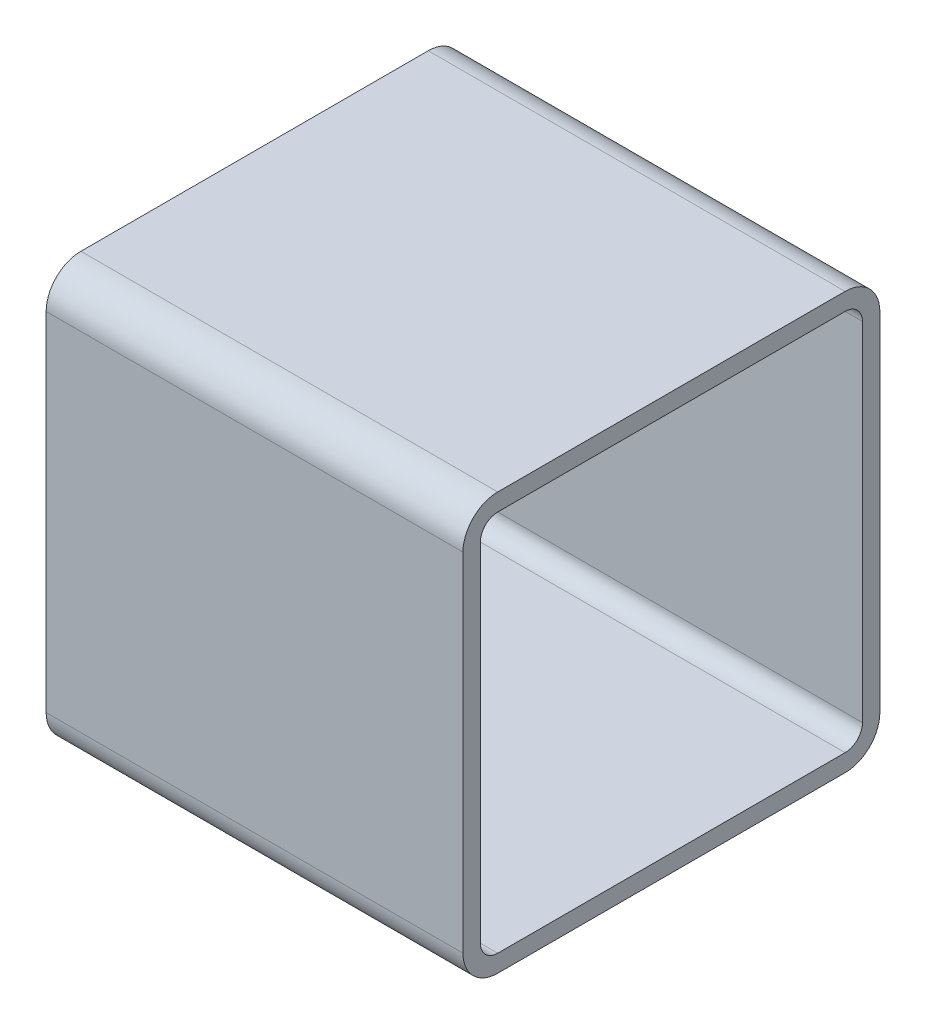
ISO-10303-21;
HEADER;
FILE_DESCRIPTION(('STEP AP214'),'2;1');
FILE_NAME('part.step','',(''),(''),'','','');
FILE_SCHEMA(('AUTOMOTIVE_DESIGN { 1 0 10303 214 1 1 1 1 }'));
ENDSEC;
DATA;
#1=APPLICATION_CONTEXT('core data for automotive mechanical design processes');
#2=APPLICATION_PROTOCOL_DEFINITION('international standard','automotive_design',2000,#1);
#3=PRODUCT_CONTEXT('',#1,'mechanical');
#4=PRODUCT('Part','Part','',(#3));
#5=PRODUCT_RELATED_PRODUCT_CATEGORY('part','',(#4));
#6=PRODUCT_DEFINITION_FORMATION('','',#4);
#7=PRODUCT_DEFINITION_CONTEXT('part definition',#1,'design');
#8=PRODUCT_DEFINITION('design','',#6,#7);
#9=PRODUCT_DEFINITION_SHAPE('','',#8);
#10=(LENGTH_UNIT() NAMED_UNIT(*) SI_UNIT(.MILLI.,.METRE.));
#11=(NAMED_UNIT(*) PLANE_ANGLE_UNIT() SI_UNIT($,.RADIAN.));
#12=(NAMED_UNIT(*) SI_UNIT($,.STERADIAN.) SOLID_ANGLE_UNIT());
#13=UNCERTAINTY_MEASURE_WITH_UNIT(LENGTH_MEASURE(1.E-05),#10,'distance_accuracy_value','');
#14=(GEOMETRIC_REPRESENTATION_CONTEXT(3) GLOBAL_UNCERTAINTY_ASSIGNED_CONTEXT((#13)) GLOBAL_UNIT_ASSIGNED_CONTEXT((#10,
#11,#12)) REPRESENTATION_CONTEXT('',''));
#15=CARTESIAN_POINT('',(0.,0.,0.));
#16=DIRECTION('',(0.,0.,1.));
#17=DIRECTION('',(1.,0.,0.));
#18=AXIS2_PLACEMENT_3D('',#15,#16,#17);
#19=CARTESIAN_POINT('',(0.,6.35,-38.1));
#20=DIRECTION('',(0.,0.,-1.));
#21=DIRECTION('',(-1.,0.,0.));
#22=AXIS2_PLACEMENT_3D('',#19,#20,#21);
#23=PLANE('',#22);
#24=DIRECTION('',(1.,0.,0.));
#25=VECTOR('',#24,1.);
#26=CARTESIAN_POINT('',(0.,6.35,-38.1));
#27=LINE('',#26,#25);
#28=CARTESIAN_POINT('',(0.,6.35,-38.1));
#29=VERTEX_POINT('',#28);
#30=CARTESIAN_POINT('',(76.2,6.35,-38.1));
#31=VERTEX_POINT('',#30);
#32=EDGE_CURVE('E111',#29,#31,#27,.T.);
#33=ORIENTED_EDGE('',*,*,#32,.F.);
#34=DIRECTION('',(0.,1.,0.));
#35=VECTOR('',#34,1.);
#36=CARTESIAN_POINT('',(0.,0.,-38.1));
#37=LINE('',#36,#35);
#38=CARTESIAN_POINT('',(0.,69.85,-38.1));
#39=VERTEX_POINT('',#38);
#40=EDGE_CURVE('E213',#29,#39,#37,.T.);
#41=ORIENTED_EDGE('',*,*,#40,.T.);
#42=DIRECTION('',(1.,0.,0.));
#43=VECTOR('',#42,1.);
#44=CARTESIAN_POINT('',(0.,69.85,-38.1));
#45=LINE('',#44,#43);
#46=CARTESIAN_POINT('',(76.2,69.85,-38.1));
#47=VERTEX_POINT('',#46);
#48=EDGE_CURVE('E188',#47,#39,#45,.F.);
#49=ORIENTED_EDGE('',*,*,#48,.F.);
#50=DIRECTION('',(0.,1.,0.));
#51=VECTOR('',#50,1.);
#52=CARTESIAN_POINT('',(76.2,0.,-38.1));
#53=LINE('',#52,#51);
#54=EDGE_CURVE('E115',#31,#47,#53,.T.);
#55=ORIENTED_EDGE('',*,*,#54,.F.);
#56=EDGE_LOOP('',(#33,#41,#49,#55));
#57=FACE_BOUND('',#56,.T.);
#58=ADVANCED_FACE('F17',(#57),#23,.T.);
#59=CARTESIAN_POINT('',(0.,69.85,-31.75));
#60=DIRECTION('',(1.,0.,0.));
#61=DIRECTION('',(0.,0.,-1.));
#62=AXIS2_PLACEMENT_3D('',#59,#60,#61);
#63=CYLINDRICAL_SURFACE('',#62,6.35);
#64=ORIENTED_EDGE('',*,*,#48,.T.);
#65=CARTESIAN_POINT('',(0.,69.85,-31.75));
#66=DIRECTION('',(1.,0.,0.));
#67=DIRECTION('',(0.,0.,-1.));
#68=AXIS2_PLACEMENT_3D('',#65,#66,#67);
#69=CIRCLE('',#68,6.35);
#70=CARTESIAN_POINT('',(0.,76.2,-31.75));
#71=VERTEX_POINT('',#70);
#72=EDGE_CURVE('E211',#39,#71,#69,.T.);
#73=ORIENTED_EDGE('',*,*,#72,.T.);
#74=DIRECTION('',(1.,0.,0.));
#75=VECTOR('',#74,1.);
#76=CARTESIAN_POINT('',(0.,76.2,-31.75));
#77=LINE('',#76,#75);
#78=CARTESIAN_POINT('',(76.2,76.2,-31.75));
#79=VERTEX_POINT('',#78);
#80=EDGE_CURVE('E185',#79,#71,#77,.F.);
#81=ORIENTED_EDGE('',*,*,#80,.F.);
#82=CARTESIAN_POINT('',(76.2,69.85,-31.75));
#83=DIRECTION('',(1.,0.,0.));
#84=DIRECTION('',(0.,0.,-1.));
#85=AXIS2_PLACEMENT_3D('',#82,#83,#84);
#86=CIRCLE('',#85,6.35);
#87=EDGE_CURVE('E154',#47,#79,#86,.T.);
#88=ORIENTED_EDGE('',*,*,#87,.F.);
#89=EDGE_LOOP('',(#64,#73,#81,#88));
#90=FACE_BOUND('',#89,.T.);
#91=ADVANCED_FACE('F229',(#90),#63,.T.);
#92=CARTESIAN_POINT('',(0.,76.2,-31.75));
#93=DIRECTION('',(0.,1.,0.));
#94=DIRECTION('',(0.,0.,1.));
#95=AXIS2_PLACEMENT_3D('',#92,#93,#94);
#96=PLANE('',#95);
#97=ORIENTED_EDGE('',*,*,#80,.T.);
#98=DIRECTION('',(0.,0.,-1.));
#99=VECTOR('',#98,1.);
#100=CARTESIAN_POINT('',(0.,76.2,0.));
#101=LINE('',#100,#99);
#102=CARTESIAN_POINT('',(0.,76.2,31.75));
#103=VERTEX_POINT('',#102);
#104=EDGE_CURVE('E210',#71,#103,#101,.F.);
#105=ORIENTED_EDGE('',*,*,#104,.T.);
#106=DIRECTION('',(1.,0.,0.));
#107=VECTOR('',#106,1.);
#108=CARTESIAN_POINT('',(0.,76.2,31.75));
#109=LINE('',#108,#107);
#110=CARTESIAN_POINT('',(76.2,76.2,31.75));
#111=VERTEX_POINT('',#110);
#112=EDGE_CURVE('E182',#111,#103,#109,.F.);
#113=ORIENTED_EDGE('',*,*,#112,.F.);
#114=DIRECTION('',(0.,0.,-1.));
#115=VECTOR('',#114,1.);
#116=CARTESIAN_POINT('',(76.2,76.2,0.));
#117=LINE('',#116,#115);
#118=EDGE_CURVE('E151',#79,#111,#117,.F.);
#119=ORIENTED_EDGE('',*,*,#118,.F.);
#120=EDGE_LOOP('',(#97,#105,#113,#119));
#121=FACE_BOUND('',#120,.T.);
#122=ADVANCED_FACE('F233',(#121),#96,.T.);
#123=CARTESIAN_POINT('',(0.,69.85,31.75));
#124=DIRECTION('',(1.,0.,0.));
#125=DIRECTION('',(0.,0.,-1.));
#126=AXIS2_PLACEMENT_3D('',#123,#124,#125);
#127=CYLINDRICAL_SURFACE('',#126,6.35);
#128=ORIENTED_EDGE('',*,*,#112,.T.);
#129=CARTESIAN_POINT('',(0.,69.85,31.75));
#130=DIRECTION('',(1.,0.,0.));
#131=DIRECTION('',(0.,0.,-1.));
#132=AXIS2_PLACEMENT_3D('',#129,#130,#131);
#133=CIRCLE('',#132,6.35);
#134=CARTESIAN_POINT('',(0.,69.85,38.1));
#135=VERTEX_POINT('',#134);
#136=EDGE_CURVE('E208',#103,#135,#133,.T.);
#137=ORIENTED_EDGE('',*,*,#136,.T.);
#138=DIRECTION('',(1.,0.,0.));
#139=VECTOR('',#138,1.);
#140=CARTESIAN_POINT('',(0.,69.85,38.1));
#141=LINE('',#140,#139);
#142=CARTESIAN_POINT('',(76.2,69.85,38.1));
#143=VERTEX_POINT('',#142);
#144=EDGE_CURVE('E176',#143,#135,#141,.F.);
#145=ORIENTED_EDGE('',*,*,#144,.F.);
#146=CARTESIAN_POINT('',(76.2,69.85,31.75));
#147=DIRECTION('',(1.,0.,0.));
#148=DIRECTION('',(0.,0.,-1.));
#149=AXIS2_PLACEMENT_3D('',#146,#147,#148);
#150=CIRCLE('',#149,6.35);
#151=EDGE_CURVE('E150',#111,#143,#150,.T.);
#152=ORIENTED_EDGE('',*,*,#151,.F.);
#153=EDGE_LOOP('',(#128,#137,#145,#152));
#154=FACE_BOUND('',#153,.T.);
#155=ADVANCED_FACE('F237',(#154),#127,.T.);
#156=CARTESIAN_POINT('',(0.,69.85,38.1));
#157=DIRECTION('',(0.,0.,1.));
#158=DIRECTION('',(1.,0.,0.));
#159=AXIS2_PLACEMENT_3D('',#156,#157,#158);
#160=PLANE('',#159);
#161=ORIENTED_EDGE('',*,*,#144,.T.);
#162=DIRECTION('',(0.,1.,0.));
#163=VECTOR('',#162,1.);
#164=CARTESIAN_POINT('',(0.,0.,38.1));
#165=LINE('',#164,#163);
#166=CARTESIAN_POINT('',(0.,6.35,38.1));
#167=VERTEX_POINT('',#166);
#168=EDGE_CURVE('E207',#135,#167,#165,.F.);
#169=ORIENTED_EDGE('',*,*,#168,.T.);
#170=DIRECTION('',(1.,0.,0.));
#171=VECTOR('',#170,1.);
#172=CARTESIAN_POINT('',(0.,6.35,38.1));
#173=LINE('',#172,#171);
#174=CARTESIAN_POINT('',(76.2,6.35,38.1));
#175=VERTEX_POINT('',#174);
#176=EDGE_CURVE('E177',#175,#167,#173,.F.);
#177=ORIENTED_EDGE('',*,*,#176,.F.);
#178=DIRECTION('',(0.,1.,0.));
#179=VECTOR('',#178,1.);
#180=CARTESIAN_POINT('',(76.2,0.,38.1));
#181=LINE('',#180,#179);
#182=EDGE_CURVE('E148',#143,#175,#181,.F.);
#183=ORIENTED_EDGE('',*,*,#182,.F.);
#184=EDGE_LOOP('',(#161,#169,#177,#183));
#185=FACE_BOUND('',#184,.T.);
#186=ADVANCED_FACE('F242',(#185),#160,.T.);
#187=CARTESIAN_POINT('',(0.,69.85,-31.75));
#188=DIRECTION('',(1.,0.,0.));
#189=DIRECTION('',(0.,0.,-1.));
#190=AXIS2_PLACEMENT_3D('',#187,#188,#189);
#191=CYLINDRICAL_SURFACE('',#190,3.175);
#192=CARTESIAN_POINT('',(76.2,69.85,-31.75));
#193=DIRECTION('',(1.,0.,0.));
#194=DIRECTION('',(0.,0.,-1.));
#195=AXIS2_PLACEMENT_3D('',#192,#193,#194);
#196=CIRCLE('',#195,3.175);
#197=CARTESIAN_POINT('',(76.2,73.025,-31.75));
#198=VERTEX_POINT('',#197);
#199=CARTESIAN_POINT('',(76.2,69.85,-34.925));
#200=VERTEX_POINT('',#199);
#201=EDGE_CURVE('E135',#198,#200,#196,.F.);
#202=ORIENTED_EDGE('',*,*,#201,.F.);
#203=DIRECTION('',(1.,0.,0.));
#204=VECTOR('',#203,1.);
#205=CARTESIAN_POINT('',(0.,73.025,-31.75));
#206=LINE('',#205,#204);
#207=CARTESIAN_POINT('',(0.,73.025,-31.75));
#208=VERTEX_POINT('',#207);
#209=EDGE_CURVE('E159',#208,#198,#206,.T.);
#210=ORIENTED_EDGE('',*,*,#209,.F.);
#211=CARTESIAN_POINT('',(0.,69.85,-31.75));
#212=DIRECTION('',(1.,0.,0.));
#213=DIRECTION('',(0.,0.,-1.));
#214=AXIS2_PLACEMENT_3D('',#211,#212,#213);
#215=CIRCLE('',#214,3.175);
#216=CARTESIAN_POINT('',(0.,69.85,-34.925));
#217=VERTEX_POINT('',#216);
#218=EDGE_CURVE('E203',#208,#217,#215,.F.);
#219=ORIENTED_EDGE('',*,*,#218,.T.);
#220=DIRECTION('',(1.,0.,0.));
#221=VECTOR('',#220,1.);
#222=CARTESIAN_POINT('',(0.,69.85,-34.925));
#223=LINE('',#222,#221);
#224=EDGE_CURVE('E173',#200,#217,#223,.F.);
#225=ORIENTED_EDGE('',*,*,#224,.F.);
#226=EDGE_LOOP('',(#202,#210,#219,#225));
#227=FACE_BOUND('',#226,.T.);
#228=ADVANCED_FACE('F307',(#227),#191,.F.);
#229=CARTESIAN_POINT('',(0.,69.85,-34.925));
#230=DIRECTION('',(0.,0.,1.));
#231=DIRECTION('',(1.,0.,0.));
#232=AXIS2_PLACEMENT_3D('',#229,#230,#231);
#233=PLANE('',#232);
#234=ORIENTED_EDGE('',*,*,#224,.T.);
#235=DIRECTION('',(0.,1.,0.));
#236=VECTOR('',#235,1.);
#237=CARTESIAN_POINT('',(0.,0.,-34.925));
#238=LINE('',#237,#236);
#239=CARTESIAN_POINT('',(0.,6.35,-34.925));
#240=VERTEX_POINT('',#239);
#241=EDGE_CURVE('E202',#217,#240,#238,.F.);
#242=ORIENTED_EDGE('',*,*,#241,.T.);
#243=DIRECTION('',(1.,0.,0.));
#244=VECTOR('',#243,1.);
#245=CARTESIAN_POINT('',(0.,6.35,-34.925));
#246=LINE('',#245,#244);
#247=CARTESIAN_POINT('',(76.2,6.35,-34.925));
#248=VERTEX_POINT('',#247);
#249=EDGE_CURVE('E171',#240,#248,#246,.T.);
#250=ORIENTED_EDGE('',*,*,#249,.T.);
#251=DIRECTION('',(0.,1.,0.));
#252=VECTOR('',#251,1.);
#253=CARTESIAN_POINT('',(76.2,0.,-34.925));
#254=LINE('',#253,#252);
#255=EDGE_CURVE('E145',#200,#248,#254,.F.);
#256=ORIENTED_EDGE('',*,*,#255,.F.);
#257=EDGE_LOOP('',(#234,#242,#250,#256));
#258=FACE_BOUND('',#257,.T.);
#259=ADVANCED_FACE('F306',(#258),#233,.T.);
#260=CARTESIAN_POINT('',(0.,6.35,-31.75));
#261=DIRECTION('',(1.,0.,0.));
#262=DIRECTION('',(0.,0.,-1.));
#263=AXIS2_PLACEMENT_3D('',#260,#261,#262);
#264=CYLINDRICAL_SURFACE('',#263,3.175);
#265=CARTESIAN_POINT('',(76.2,6.35,-31.75));
#266=DIRECTION('',(1.,0.,0.));
#267=DIRECTION('',(0.,0.,-1.));
#268=AXIS2_PLACEMENT_3D('',#265,#266,#267);
#269=CIRCLE('',#268,3.175);
#270=CARTESIAN_POINT('',(76.2,3.175,-31.75));
#271=VERTEX_POINT('',#270);
#272=EDGE_CURVE('E144',#248,#271,#269,.F.);
#273=ORIENTED_EDGE('',*,*,#272,.F.);
#274=ORIENTED_EDGE('',*,*,#249,.F.);
#275=CARTESIAN_POINT('',(0.,6.35,-31.75));
#276=DIRECTION('',(1.,0.,0.));
#277=DIRECTION('',(0.,0.,-1.));
#278=AXIS2_PLACEMENT_3D('',#275,#276,#277);
#279=CIRCLE('',#278,3.175);
#280=CARTESIAN_POINT('',(0.,3.175,-31.75));
#281=VERTEX_POINT('',#280);
#282=EDGE_CURVE('E199',#240,#281,#279,.F.);
#283=ORIENTED_EDGE('',*,*,#282,.T.);
#284=DIRECTION('',(1.,0.,0.));
#285=VECTOR('',#284,1.);
#286=CARTESIAN_POINT('',(0.,3.175,-31.75));
#287=LINE('',#286,#285);
#288=EDGE_CURVE('E168',#271,#281,#287,.F.);
#289=ORIENTED_EDGE('',*,*,#288,.F.);
#290=EDGE_LOOP('',(#273,#274,#283,#289));
#291=FACE_BOUND('',#290,.T.);
#292=ADVANCED_FACE('F304',(#291),#264,.F.);
#293=CARTESIAN_POINT('',(0.,3.175,-31.75));
#294=DIRECTION('',(0.,1.,0.));
#295=DIRECTION('',(0.,0.,1.));
#296=AXIS2_PLACEMENT_3D('',#293,#294,#295);
#297=PLANE('',#296);
#298=ORIENTED_EDGE('',*,*,#288,.T.);
#299=DIRECTION('',(0.,0.,-1.));
#300=VECTOR('',#299,1.);
#301=CARTESIAN_POINT('',(0.,3.175,0.));
#302=LINE('',#301,#300);
#303=CARTESIAN_POINT('',(0.,3.175,31.75));
#304=VERTEX_POINT('',#303);
#305=EDGE_CURVE('E198',#281,#304,#302,.F.);
#306=ORIENTED_EDGE('',*,*,#305,.T.);
#307=DIRECTION('',(1.,0.,0.));
#308=VECTOR('',#307,1.);
#309=CARTESIAN_POINT('',(0.,3.175,31.75));
#310=LINE('',#309,#308);
#311=CARTESIAN_POINT('',(76.2,3.175,31.75));
#312=VERTEX_POINT('',#311);
#313=EDGE_CURVE('E166',#304,#312,#310,.T.);
#314=ORIENTED_EDGE('',*,*,#313,.T.);
#315=DIRECTION('',(0.,0.,-1.));
#316=VECTOR('',#315,1.);
#317=CARTESIAN_POINT('',(76.2,3.175,0.));
#318=LINE('',#317,#316);
#319=EDGE_CURVE('E141',#271,#312,#318,.F.);
#320=ORIENTED_EDGE('',*,*,#319,.F.);
#321=EDGE_LOOP('',(#298,#306,#314,#320));
#322=FACE_BOUND('',#321,.T.);
#323=ADVANCED_FACE('F293',(#322),#297,.T.);
#324=CARTESIAN_POINT('',(0.,6.35,31.75));
#325=DIRECTION('',(1.,0.,0.));
#326=DIRECTION('',(0.,0.,-1.));
#327=AXIS2_PLACEMENT_3D('',#324,#325,#326);
#328=CYLINDRICAL_SURFACE('',#327,3.175);
#329=CARTESIAN_POINT('',(76.2,6.35,31.75));
#330=DIRECTION('',(1.,0.,0.));
#331=DIRECTION('',(0.,0.,-1.));
#332=AXIS2_PLACEMENT_3D('',#329,#330,#331);
#333=CIRCLE('',#332,3.175);
#334=CARTESIAN_POINT('',(76.2,6.35,34.925));
#335=VERTEX_POINT('',#334);
#336=EDGE_CURVE('E140',#312,#335,#333,.F.);
#337=ORIENTED_EDGE('',*,*,#336,.F.);
#338=ORIENTED_EDGE('',*,*,#313,.F.);
#339=CARTESIAN_POINT('',(0.,6.35,31.75));
#340=DIRECTION('',(1.,0.,0.));
#341=DIRECTION('',(0.,0.,-1.));
#342=AXIS2_PLACEMENT_3D('',#339,#340,#341);
#343=CIRCLE('',#342,3.175);
#344=CARTESIAN_POINT('',(0.,6.35,34.925));
#345=VERTEX_POINT('',#344);
#346=EDGE_CURVE('E195',#304,#345,#343,.F.);
#347=ORIENTED_EDGE('',*,*,#346,.T.);
#348=DIRECTION('',(-1.,0.,0.));
#349=VECTOR('',#348,1.);
#350=CARTESIAN_POINT('',(0.,6.35,34.925));
#351=LINE('',#350,#349);
#352=EDGE_CURVE('E163',#335,#345,#351,.T.);
#353=ORIENTED_EDGE('',*,*,#352,.F.);
#354=EDGE_LOOP('',(#337,#338,#347,#353));
#355=FACE_BOUND('',#354,.T.);
#356=ADVANCED_FACE('F298',(#355),#328,.F.);
#357=CARTESIAN_POINT('',(0.,6.35,34.925));
#358=DIRECTION('',(0.,0.,-1.));
#359=DIRECTION('',(-1.,0.,0.));
#360=AXIS2_PLACEMENT_3D('',#357,#358,#359);
#361=PLANE('',#360);
#362=ORIENTED_EDGE('',*,*,#352,.T.);
#363=DIRECTION('',(0.,1.,0.));
#364=VECTOR('',#363,1.);
#365=CARTESIAN_POINT('',(0.,0.,34.925));
#366=LINE('',#365,#364);
#367=CARTESIAN_POINT('',(0.,69.85,34.925));
#368=VERTEX_POINT('',#367);
#369=EDGE_CURVE('E194',#345,#368,#366,.T.);
#370=ORIENTED_EDGE('',*,*,#369,.T.);
#371=DIRECTION('',(1.,0.,0.));
#372=VECTOR('',#371,1.);
#373=CARTESIAN_POINT('',(0.,69.85,34.925));
#374=LINE('',#373,#372);
#375=CARTESIAN_POINT('',(76.2,69.85,34.925));
#376=VERTEX_POINT('',#375);
#377=EDGE_CURVE('E161',#368,#376,#374,.T.);
#378=ORIENTED_EDGE('',*,*,#377,.T.);
#379=DIRECTION('',(0.,1.,0.));
#380=VECTOR('',#379,1.);
#381=CARTESIAN_POINT('',(76.2,0.,34.925));
#382=LINE('',#381,#380);
#383=EDGE_CURVE('E137',#335,#376,#382,.T.);
#384=ORIENTED_EDGE('',*,*,#383,.F.);
#385=EDGE_LOOP('',(#362,#370,#378,#384));
#386=FACE_BOUND('',#385,.T.);
#387=ADVANCED_FACE('F258',(#386),#361,.T.);
#388=CARTESIAN_POINT('',(0.,69.85,31.75));
#389=DIRECTION('',(1.,0.,0.));
#390=DIRECTION('',(0.,0.,-1.));
#391=AXIS2_PLACEMENT_3D('',#388,#389,#390);
#392=CYLINDRICAL_SURFACE('',#391,3.175);
#393=CARTESIAN_POINT('',(76.2,69.85,31.75));
#394=DIRECTION('',(1.,0.,0.));
#395=DIRECTION('',(0.,0.,-1.));
#396=AXIS2_PLACEMENT_3D('',#393,#394,#395);
#397=CIRCLE('',#396,3.175);
#398=CARTESIAN_POINT('',(76.2,73.025,31.75));
#399=VERTEX_POINT('',#398);
#400=EDGE_CURVE('E136',#376,#399,#397,.F.);
#401=ORIENTED_EDGE('',*,*,#400,.F.);
#402=ORIENTED_EDGE('',*,*,#377,.F.);
#403=CARTESIAN_POINT('',(0.,69.85,31.75));
#404=DIRECTION('',(1.,0.,0.));
#405=DIRECTION('',(0.,0.,-1.));
#406=AXIS2_PLACEMENT_3D('',#403,#404,#405);
#407=CIRCLE('',#406,3.175);
#408=CARTESIAN_POINT('',(0.,73.025,31.75));
#409=VERTEX_POINT('',#408);
#410=EDGE_CURVE('E128',#368,#409,#407,.F.);
#411=ORIENTED_EDGE('',*,*,#410,.T.);
#412=DIRECTION('',(1.,0.,0.));
#413=VECTOR('',#412,1.);
#414=CARTESIAN_POINT('',(0.,73.025,31.75));
#415=LINE('',#414,#413);
#416=EDGE_CURVE('E156',#399,#409,#415,.F.);
#417=ORIENTED_EDGE('',*,*,#416,.F.);
#418=EDGE_LOOP('',(#401,#402,#411,#417));
#419=FACE_BOUND('',#418,.T.);
#420=ADVANCED_FACE('F267',(#419),#392,.F.);
#421=CARTESIAN_POINT('',(0.,73.025,31.75));
#422=DIRECTION('',(0.,-1.,0.));
#423=DIRECTION('',(0.,0.,-1.));
#424=AXIS2_PLACEMENT_3D('',#421,#422,#423);
#425=PLANE('',#424);
#426=ORIENTED_EDGE('',*,*,#416,.T.);
#427=DIRECTION('',(0.,0.,-1.));
#428=VECTOR('',#427,1.);
#429=CARTESIAN_POINT('',(0.,73.025,0.));
#430=LINE('',#429,#428);
#431=EDGE_CURVE('E125',#409,#208,#430,.T.);
#432=ORIENTED_EDGE('',*,*,#431,.T.);
#433=ORIENTED_EDGE('',*,*,#209,.T.);
#434=DIRECTION('',(0.,0.,-1.));
#435=VECTOR('',#434,1.);
#436=CARTESIAN_POINT('',(76.2,73.025,0.));
#437=LINE('',#436,#435);
#438=EDGE_CURVE('E132',#399,#198,#437,.T.);
#439=ORIENTED_EDGE('',*,*,#438,.F.);
#440=EDGE_LOOP('',(#426,#432,#433,#439));
#441=FACE_BOUND('',#440,.T.);
#442=ADVANCED_FACE('F276',(#441),#425,.T.);
#443=CARTESIAN_POINT('',(0.,6.35,-31.75));
#444=DIRECTION('',(1.,0.,0.));
#445=DIRECTION('',(0.,0.,-1.));
#446=AXIS2_PLACEMENT_3D('',#443,#444,#445);
#447=CYLINDRICAL_SURFACE('',#446,6.35);
#448=DIRECTION('',(1.,0.,0.));
#449=VECTOR('',#448,1.);
#450=CARTESIAN_POINT('',(0.,0.,-31.75));
#451=LINE('',#450,#449);
#452=CARTESIAN_POINT('',(0.,0.,-31.75));
#453=VERTEX_POINT('',#452);
#454=CARTESIAN_POINT('',(76.2,0.,-31.75));
#455=VERTEX_POINT('',#454);
#456=EDGE_CURVE('E109',#453,#455,#451,.T.);
#457=ORIENTED_EDGE('',*,*,#456,.F.);
#458=CARTESIAN_POINT('',(0.,6.35,-31.75));
#459=DIRECTION('',(1.,0.,0.));
#460=DIRECTION('',(0.,0.,-1.));
#461=AXIS2_PLACEMENT_3D('',#458,#459,#460);
#462=CIRCLE('',#461,6.35);
#463=EDGE_CURVE('E179',#453,#29,#462,.T.);
#464=ORIENTED_EDGE('',*,*,#463,.T.);
#465=ORIENTED_EDGE('',*,*,#32,.T.);
#466=CARTESIAN_POINT('',(76.2,6.35,-31.75));
#467=DIRECTION('',(1.,0.,0.));
#468=DIRECTION('',(0.,0.,-1.));
#469=AXIS2_PLACEMENT_3D('',#466,#467,#468);
#470=CIRCLE('',#469,6.35);
#471=EDGE_CURVE('E20',#455,#31,#470,.T.);
#472=ORIENTED_EDGE('',*,*,#471,.F.);
#473=EDGE_LOOP('',(#457,#464,#465,#472));
#474=FACE_BOUND('',#473,.T.);
#475=ADVANCED_FACE('F106',(#474),#447,.T.);
#476=CARTESIAN_POINT('',(76.2,0.,0.));
#477=DIRECTION('',(1.,0.,0.));
#478=DIRECTION('',(0.,0.,-1.));
#479=AXIS2_PLACEMENT_3D('',#476,#477,#478);
#480=PLANE('',#479);
#481=ORIENTED_EDGE('',*,*,#438,.T.);
#482=ORIENTED_EDGE('',*,*,#201,.T.);
#483=ORIENTED_EDGE('',*,*,#255,.T.);
#484=ORIENTED_EDGE('',*,*,#272,.T.);
#485=ORIENTED_EDGE('',*,*,#319,.T.);
#486=ORIENTED_EDGE('',*,*,#336,.T.);
#487=ORIENTED_EDGE('',*,*,#383,.T.);
#488=ORIENTED_EDGE('',*,*,#400,.T.);
#489=EDGE_LOOP('',(#481,#482,#483,#484,#485,#486,#487,#488));
#490=FACE_BOUND('',#489,.T.);
#491=CARTESIAN_POINT('',(76.2,6.35,31.75));
#492=DIRECTION('',(1.,0.,0.));
#493=DIRECTION('',(0.,0.,-1.));
#494=AXIS2_PLACEMENT_3D('',#491,#492,#493);
#495=CIRCLE('',#494,6.35);
#496=CARTESIAN_POINT('',(76.2,0.,31.75));
#497=VERTEX_POINT('',#496);
#498=EDGE_CURVE('E120',#497,#175,#495,.F.);
#499=ORIENTED_EDGE('',*,*,#498,.F.);
#500=DIRECTION('',(0.,0.,-1.));
#501=VECTOR('',#500,1.);
#502=CARTESIAN_POINT('',(76.2,0.,31.75));
#503=LINE('',#502,#501);
#504=EDGE_CURVE('E117',#455,#497,#503,.F.);
#505=ORIENTED_EDGE('',*,*,#504,.F.);
#506=ORIENTED_EDGE('',*,*,#471,.T.);
#507=ORIENTED_EDGE('',*,*,#54,.T.);
#508=ORIENTED_EDGE('',*,*,#87,.T.);
#509=ORIENTED_EDGE('',*,*,#118,.T.);
#510=ORIENTED_EDGE('',*,*,#151,.T.);
#511=ORIENTED_EDGE('',*,*,#182,.T.);
#512=EDGE_LOOP('',(#499,#505,#506,#507,#508,#509,#510,#511));
#513=FACE_BOUND('',#512,.T.);
#514=ADVANCED_FACE('F118',(#490,#513),#480,.T.);
#515=CARTESIAN_POINT('',(0.,6.35,31.75));
#516=DIRECTION('',(1.,0.,0.));
#517=DIRECTION('',(0.,0.,-1.));
#518=AXIS2_PLACEMENT_3D('',#515,#516,#517);
#519=CYLINDRICAL_SURFACE('',#518,6.35);
#520=ORIENTED_EDGE('',*,*,#176,.T.);
#521=CARTESIAN_POINT('',(0.,6.35,31.75));
#522=DIRECTION('',(1.,0.,0.));
#523=DIRECTION('',(0.,0.,-1.));
#524=AXIS2_PLACEMENT_3D('',#521,#522,#523);
#525=CIRCLE('',#524,6.35);
#526=CARTESIAN_POINT('',(0.,0.,31.75));
#527=VERTEX_POINT('',#526);
#528=EDGE_CURVE('E35',#167,#527,#525,.T.);
#529=ORIENTED_EDGE('',*,*,#528,.T.);
#530=DIRECTION('',(1.,0.,0.));
#531=VECTOR('',#530,1.);
#532=CARTESIAN_POINT('',(0.,0.,31.75));
#533=LINE('',#532,#531);
#534=EDGE_CURVE('E26',#497,#527,#533,.F.);
#535=ORIENTED_EDGE('',*,*,#534,.F.);
#536=ORIENTED_EDGE('',*,*,#498,.T.);
#537=EDGE_LOOP('',(#520,#529,#535,#536));
#538=FACE_BOUND('',#537,.T.);
#539=ADVANCED_FACE('F244',(#538),#519,.T.);
#540=CARTESIAN_POINT('',(0.,0.,0.));
#541=DIRECTION('',(1.,0.,0.));
#542=DIRECTION('',(0.,0.,-1.));
#543=AXIS2_PLACEMENT_3D('',#540,#541,#542);
#544=PLANE('',#543);
#545=ORIENTED_EDGE('',*,*,#410,.F.);
#546=ORIENTED_EDGE('',*,*,#369,.F.);
#547=ORIENTED_EDGE('',*,*,#346,.F.);
#548=ORIENTED_EDGE('',*,*,#305,.F.);
#549=ORIENTED_EDGE('',*,*,#282,.F.);
#550=ORIENTED_EDGE('',*,*,#241,.F.);
#551=ORIENTED_EDGE('',*,*,#218,.F.);
#552=ORIENTED_EDGE('',*,*,#431,.F.);
#553=EDGE_LOOP('',(#545,#546,#547,#548,#549,#550,#551,#552));
#554=FACE_BOUND('',#553,.T.);
#555=ORIENTED_EDGE('',*,*,#168,.F.);
#556=ORIENTED_EDGE('',*,*,#136,.F.);
#557=ORIENTED_EDGE('',*,*,#104,.F.);
#558=ORIENTED_EDGE('',*,*,#72,.F.);
#559=ORIENTED_EDGE('',*,*,#40,.F.);
#560=ORIENTED_EDGE('',*,*,#463,.F.);
#561=DIRECTION('',(0.,0.,-1.));
#562=VECTOR('',#561,1.);
#563=CARTESIAN_POINT('',(0.,0.,31.75));
#564=LINE('',#563,#562);
#565=EDGE_CURVE('E11',#527,#453,#564,.T.);
#566=ORIENTED_EDGE('',*,*,#565,.F.);
#567=ORIENTED_EDGE('',*,*,#528,.F.);
#568=EDGE_LOOP('',(#555,#556,#557,#558,#559,#560,#566,#567));
#569=FACE_BOUND('',#568,.T.);
#570=ADVANCED_FACE('F269',(#554,#569),#544,.F.);
#571=CARTESIAN_POINT('',(0.,0.,31.75));
#572=DIRECTION('',(0.,-1.,0.));
#573=DIRECTION('',(0.,0.,-1.));
#574=AXIS2_PLACEMENT_3D('',#571,#572,#573);
#575=PLANE('',#574);
#576=ORIENTED_EDGE('',*,*,#534,.T.);
#577=ORIENTED_EDGE('',*,*,#565,.T.);
#578=ORIENTED_EDGE('',*,*,#456,.T.);
#579=ORIENTED_EDGE('',*,*,#504,.T.);
#580=EDGE_LOOP('',(#576,#577,#578,#579));
#581=FACE_BOUND('',#580,.T.);
#582=ADVANCED_FACE('F124',(#581),#575,.T.);
#583=CLOSED_SHELL('',(#58,#91,#122,#155,#186,#228,#259,#292,#323,#356,#387,#420,#442,#475,#514,
#539,#570,#582));
#584=MANIFOLD_SOLID_BREP('B1',#583);
#585=ADVANCED_BREP_SHAPE_REPRESENTATION('',(#18,#584),#14);
#586=SHAPE_DEFINITION_REPRESENTATION(#9,#585);
ENDSEC;
END-ISO-10303-21;
